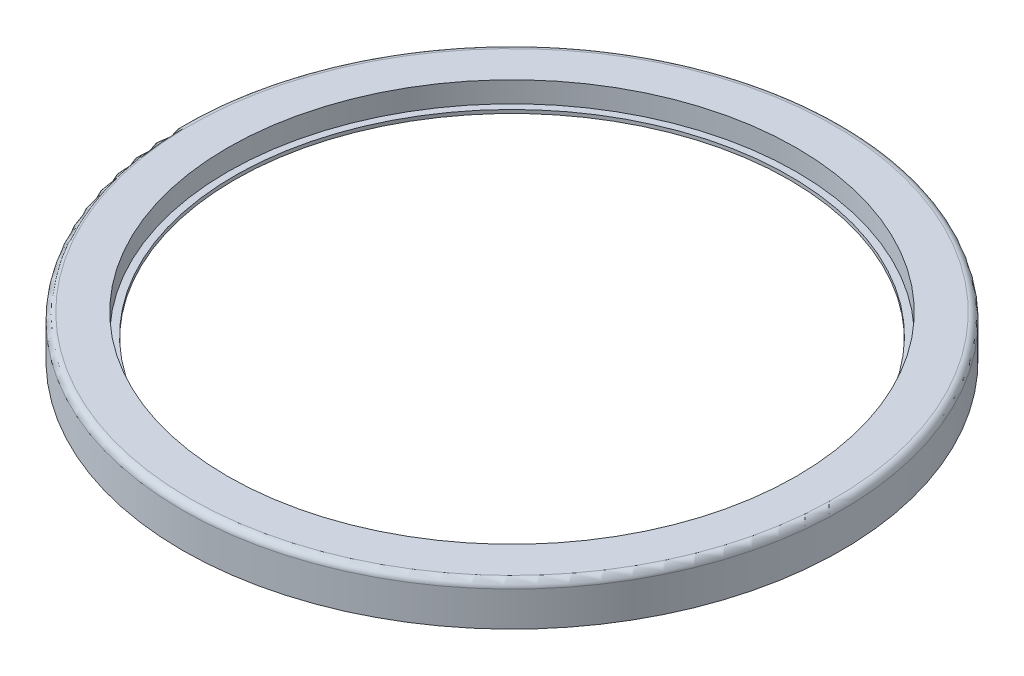
ISO-10303-21;
HEADER;
FILE_DESCRIPTION(('STEP AP214'),'2;1');
FILE_NAME('part.step','',(''),(''),'','','');
FILE_SCHEMA(('AUTOMOTIVE_DESIGN { 1 0 10303 214 1 1 1 1 }'));
ENDSEC;
DATA;
#1=APPLICATION_CONTEXT('core data for automotive mechanical design processes');
#2=APPLICATION_PROTOCOL_DEFINITION('international standard','automotive_design',2000,#1);
#3=PRODUCT_CONTEXT('',#1,'mechanical');
#4=PRODUCT('Part','Part','',(#3));
#5=PRODUCT_RELATED_PRODUCT_CATEGORY('part','',(#4));
#6=PRODUCT_DEFINITION_FORMATION('','',#4);
#7=PRODUCT_DEFINITION_CONTEXT('part definition',#1,'design');
#8=PRODUCT_DEFINITION('design','',#6,#7);
#9=PRODUCT_DEFINITION_SHAPE('','',#8);
#10=(LENGTH_UNIT() NAMED_UNIT(*) SI_UNIT(.MILLI.,.METRE.));
#11=(NAMED_UNIT(*) PLANE_ANGLE_UNIT() SI_UNIT($,.RADIAN.));
#12=(NAMED_UNIT(*) SI_UNIT($,.STERADIAN.) SOLID_ANGLE_UNIT());
#13=UNCERTAINTY_MEASURE_WITH_UNIT(LENGTH_MEASURE(1.E-05),#10,'distance_accuracy_value','');
#14=(GEOMETRIC_REPRESENTATION_CONTEXT(3) GLOBAL_UNCERTAINTY_ASSIGNED_CONTEXT((#13)) GLOBAL_UNIT_ASSIGNED_CONTEXT((#10,
#11,#12)) REPRESENTATION_CONTEXT('',''));
#15=CARTESIAN_POINT('',(0.,0.,0.));
#16=DIRECTION('',(0.,0.,1.));
#17=DIRECTION('',(1.,0.,0.));
#18=AXIS2_PLACEMENT_3D('',#15,#16,#17);
#19=CARTESIAN_POINT('',(0.,-4.,0.));
#20=DIRECTION('',(0.,1.,0.));
#21=DIRECTION('',(0.,0.,1.));
#22=AXIS2_PLACEMENT_3D('',#19,#20,#21);
#23=CYLINDRICAL_SURFACE('',#22,45.7);
#24=CARTESIAN_POINT('',(0.,0.,0.));
#25=DIRECTION('',(0.,-1.,0.));
#26=DIRECTION('',(0.,0.,-1.));
#27=AXIS2_PLACEMENT_3D('',#24,#25,#26);
#28=CIRCLE('',#27,45.7);
#29=CARTESIAN_POINT('',(0.,0.,-45.7));
#30=VERTEX_POINT('',#29);
#31=EDGE_CURVE('E67',#30,#30,#28,.T.);
#32=ORIENTED_EDGE('',*,*,#31,.F.);
#33=EDGE_LOOP('',(#32));
#34=FACE_BOUND('',#33,.T.);
#35=CARTESIAN_POINT('',(0.,-2.5,0.));
#36=DIRECTION('',(0.,-1.,0.));
#37=DIRECTION('',(0.,0.,-1.));
#38=AXIS2_PLACEMENT_3D('',#35,#36,#37);
#39=CIRCLE('',#38,45.7);
#40=CARTESIAN_POINT('',(0.,-2.5,-45.7));
#41=VERTEX_POINT('',#40);
#42=EDGE_CURVE('E87',#41,#41,#39,.T.);
#43=ORIENTED_EDGE('',*,*,#42,.T.);
#44=EDGE_LOOP('',(#43));
#45=FACE_BOUND('',#44,.T.);
#46=ADVANCED_FACE('F39',(#34,#45),#23,.F.);
#47=CARTESIAN_POINT('',(0.,0.,0.));
#48=DIRECTION('',(0.,1.,0.));
#49=DIRECTION('',(0.,0.,1.));
#50=AXIS2_PLACEMENT_3D('',#47,#48,#49);
#51=PLANE('',#50);
#52=CARTESIAN_POINT('',(0.,0.,0.));
#53=DIRECTION('',(0.,-1.,0.));
#54=DIRECTION('',(0.,0.,-1.));
#55=AXIS2_PLACEMENT_3D('',#52,#53,#54);
#56=CIRCLE('',#55,42.25);
#57=CARTESIAN_POINT('',(0.,0.,-42.25));
#58=VERTEX_POINT('',#57);
#59=EDGE_CURVE('E52',#58,#58,#56,.T.);
#60=ORIENTED_EDGE('',*,*,#59,.F.);
#61=EDGE_LOOP('',(#60));
#62=FACE_BOUND('',#61,.T.);
#63=ORIENTED_EDGE('',*,*,#31,.T.);
#64=EDGE_LOOP('',(#63));
#65=FACE_BOUND('',#64,.T.);
#66=ADVANCED_FACE('F125',(#62,#65),#51,.F.);
#67=CARTESIAN_POINT('',(0.,2.,0.));
#68=DIRECTION('',(0.,-1.,0.));
#69=DIRECTION('',(0.,0.,-1.));
#70=AXIS2_PLACEMENT_3D('',#67,#68,#69);
#71=CYLINDRICAL_SURFACE('',#70,47.5);
#72=CARTESIAN_POINT('',(0.,1.,0.));
#73=DIRECTION('',(0.,1.,0.));
#74=DIRECTION('',(0.,0.,1.));
#75=AXIS2_PLACEMENT_3D('',#72,#73,#74);
#76=CIRCLE('',#75,47.5);
#77=CARTESIAN_POINT('',(0.,1.,47.5));
#78=VERTEX_POINT('',#77);
#79=EDGE_CURVE('E10',#78,#78,#76,.F.);
#80=ORIENTED_EDGE('',*,*,#79,.T.);
#81=EDGE_LOOP('',(#80));
#82=FACE_BOUND('',#81,.T.);
#83=CARTESIAN_POINT('',(0.,-4.,0.));
#84=DIRECTION('',(0.,-1.,0.));
#85=DIRECTION('',(0.,0.,-1.));
#86=AXIS2_PLACEMENT_3D('',#83,#84,#85);
#87=CIRCLE('',#86,47.5);
#88=CARTESIAN_POINT('',(0.,-4.,-47.5));
#89=VERTEX_POINT('',#88);
#90=EDGE_CURVE('E62',#89,#89,#87,.T.);
#91=ORIENTED_EDGE('',*,*,#90,.F.);
#92=EDGE_LOOP('',(#91));
#93=FACE_BOUND('',#92,.T.);
#94=ADVANCED_FACE('F130',(#82,#93),#71,.T.);
#95=CARTESIAN_POINT('',(0.,2.,0.));
#96=DIRECTION('',(0.,1.,0.));
#97=DIRECTION('',(0.,0.,1.));
#98=AXIS2_PLACEMENT_3D('',#95,#96,#97);
#99=PLANE('',#98);
#100=CARTESIAN_POINT('',(0.,2.,0.));
#101=DIRECTION('',(0.,1.,0.));
#102=DIRECTION('',(0.,0.,1.));
#103=AXIS2_PLACEMENT_3D('',#100,#101,#102);
#104=CIRCLE('',#103,41.);
#105=CARTESIAN_POINT('',(0.,2.,41.));
#106=VERTEX_POINT('',#105);
#107=EDGE_CURVE('E72',#106,#106,#104,.T.);
#108=ORIENTED_EDGE('',*,*,#107,.F.);
#109=EDGE_LOOP('',(#108));
#110=FACE_BOUND('',#109,.T.);
#111=CARTESIAN_POINT('',(0.,2.,0.));
#112=DIRECTION('',(0.,1.,0.));
#113=DIRECTION('',(0.,0.,1.));
#114=AXIS2_PLACEMENT_3D('',#111,#112,#113);
#115=CIRCLE('',#114,46.5);
#116=CARTESIAN_POINT('',(0.,2.,46.5));
#117=VERTEX_POINT('',#116);
#118=EDGE_CURVE('E47',#117,#117,#115,.T.);
#119=ORIENTED_EDGE('',*,*,#118,.T.);
#120=EDGE_LOOP('',(#119));
#121=FACE_BOUND('',#120,.T.);
#122=ADVANCED_FACE('F200',(#110,#121),#99,.T.);
#123=CARTESIAN_POINT('',(0.,0.,0.));
#124=DIRECTION('',(0.,1.,0.));
#125=DIRECTION('',(0.,0.,-1.));
#126=AXIS2_PLACEMENT_3D('',#123,#124,#125);
#127=CONICAL_SURFACE('',#126,42.25,0.0349065850398867);
#128=CARTESIAN_POINT('',(0.,-1.5,0.));
#129=DIRECTION('',(0.,-1.,0.));
#130=DIRECTION('',(0.,0.,-1.));
#131=AXIS2_PLACEMENT_3D('',#128,#129,#130);
#132=CIRCLE('',#131,42.1976188457624);
#133=CARTESIAN_POINT('',(0.,-1.5,-42.1976188457624));
#134=VERTEX_POINT('',#133);
#135=EDGE_CURVE('E57',#134,#134,#132,.T.);
#136=ORIENTED_EDGE('',*,*,#135,.F.);
#137=EDGE_LOOP('',(#136));
#138=FACE_BOUND('',#137,.T.);
#139=ORIENTED_EDGE('',*,*,#59,.T.);
#140=EDGE_LOOP('',(#139));
#141=FACE_BOUND('',#140,.T.);
#142=ADVANCED_FACE('F120',(#138,#141),#127,.T.);
#143=CARTESIAN_POINT('',(0.,-1.5,0.));
#144=DIRECTION('',(0.,-1.,0.));
#145=DIRECTION('',(0.,0.,-1.));
#146=AXIS2_PLACEMENT_3D('',#143,#144,#145);
#147=PLANE('',#146);
#148=CARTESIAN_POINT('',(0.,-1.5,0.));
#149=DIRECTION('',(0.,-1.,0.));
#150=DIRECTION('',(0.,0.,-1.));
#151=AXIS2_PLACEMENT_3D('',#148,#149,#150);
#152=CIRCLE('',#151,40.);
#153=CARTESIAN_POINT('',(0.,-1.5,-40.));
#154=VERTEX_POINT('',#153);
#155=EDGE_CURVE('E76',#154,#154,#152,.T.);
#156=ORIENTED_EDGE('',*,*,#155,.F.);
#157=EDGE_LOOP('',(#156));
#158=FACE_BOUND('',#157,.T.);
#159=ORIENTED_EDGE('',*,*,#135,.T.);
#160=EDGE_LOOP('',(#159));
#161=FACE_BOUND('',#160,.T.);
#162=ADVANCED_FACE('F111',(#158,#161),#147,.T.);
#163=CARTESIAN_POINT('',(0.,-4.,0.));
#164=DIRECTION('',(0.,-1.,0.));
#165=DIRECTION('',(0.,0.,-1.));
#166=AXIS2_PLACEMENT_3D('',#163,#164,#165);
#167=PLANE('',#166);
#168=ORIENTED_EDGE('',*,*,#90,.T.);
#169=EDGE_LOOP('',(#168));
#170=FACE_BOUND('',#169,.T.);
#171=CARTESIAN_POINT('',(0.,-4.,0.));
#172=DIRECTION('',(0.,-1.,0.));
#173=DIRECTION('',(0.,0.,-1.));
#174=AXIS2_PLACEMENT_3D('',#171,#172,#173);
#175=CIRCLE('',#174,45.2);
#176=CARTESIAN_POINT('',(0.,-4.,-45.2));
#177=VERTEX_POINT('',#176);
#178=EDGE_CURVE('E92',#177,#177,#175,.T.);
#179=ORIENTED_EDGE('',*,*,#178,.F.);
#180=EDGE_LOOP('',(#179));
#181=FACE_BOUND('',#180,.T.);
#182=ADVANCED_FACE('F109',(#170,#181),#167,.T.);
#183=CARTESIAN_POINT('',(0.,1.,0.));
#184=DIRECTION('',(0.,1.,0.));
#185=DIRECTION('',(0.,0.,1.));
#186=AXIS2_PLACEMENT_3D('',#183,#184,#185);
#187=TOROIDAL_SURFACE('',#186,46.5,1.);
#188=ORIENTED_EDGE('',*,*,#79,.F.);
#189=EDGE_LOOP('',(#188));
#190=FACE_BOUND('',#189,.T.);
#191=ORIENTED_EDGE('',*,*,#118,.F.);
#192=EDGE_LOOP('',(#191));
#193=FACE_BOUND('',#192,.T.);
#194=ADVANCED_FACE('F41',(#190,#193),#187,.T.);
#195=CARTESIAN_POINT('',(0.,-1.,0.));
#196=DIRECTION('',(0.,1.,0.));
#197=DIRECTION('',(0.,0.,1.));
#198=AXIS2_PLACEMENT_3D('',#195,#196,#197);
#199=CYLINDRICAL_SURFACE('',#198,41.);
#200=CARTESIAN_POINT('',(0.,-1.,0.));
#201=DIRECTION('',(0.,1.,0.));
#202=DIRECTION('',(0.,0.,1.));
#203=AXIS2_PLACEMENT_3D('',#200,#201,#202);
#204=CIRCLE('',#203,41.);
#205=CARTESIAN_POINT('',(0.,-1.,41.));
#206=VERTEX_POINT('',#205);
#207=EDGE_CURVE('E71',#206,#206,#204,.T.);
#208=ORIENTED_EDGE('',*,*,#207,.F.);
#209=EDGE_LOOP('',(#208));
#210=FACE_BOUND('',#209,.T.);
#211=ORIENTED_EDGE('',*,*,#107,.T.);
#212=EDGE_LOOP('',(#211));
#213=FACE_BOUND('',#212,.T.);
#214=ADVANCED_FACE('F118',(#210,#213),#199,.F.);
#215=CARTESIAN_POINT('',(0.,-1.,0.));
#216=DIRECTION('',(0.,1.,0.));
#217=DIRECTION('',(0.,0.,1.));
#218=AXIS2_PLACEMENT_3D('',#215,#216,#217);
#219=PLANE('',#218);
#220=CARTESIAN_POINT('',(0.,-1.,0.));
#221=DIRECTION('',(0.,1.,0.));
#222=DIRECTION('',(0.,0.,1.));
#223=AXIS2_PLACEMENT_3D('',#220,#221,#222);
#224=CIRCLE('',#223,40.);
#225=CARTESIAN_POINT('',(0.,-1.,40.));
#226=VERTEX_POINT('',#225);
#227=EDGE_CURVE('E83',#226,#226,#224,.T.);
#228=ORIENTED_EDGE('',*,*,#227,.F.);
#229=EDGE_LOOP('',(#228));
#230=FACE_BOUND('',#229,.T.);
#231=ORIENTED_EDGE('',*,*,#207,.T.);
#232=EDGE_LOOP('',(#231));
#233=FACE_BOUND('',#232,.T.);
#234=ADVANCED_FACE('F138',(#230,#233),#219,.T.);
#235=CARTESIAN_POINT('',(0.,-6.,0.));
#236=DIRECTION('',(0.,1.,0.));
#237=DIRECTION('',(0.,0.,1.));
#238=AXIS2_PLACEMENT_3D('',#235,#236,#237);
#239=CYLINDRICAL_SURFACE('',#238,40.);
#240=ORIENTED_EDGE('',*,*,#155,.T.);
#241=EDGE_LOOP('',(#240));
#242=FACE_BOUND('',#241,.T.);
#243=ORIENTED_EDGE('',*,*,#227,.T.);
#244=EDGE_LOOP('',(#243));
#245=FACE_BOUND('',#244,.T.);
#246=ADVANCED_FACE('F142',(#242,#245),#239,.F.);
#247=CARTESIAN_POINT('',(0.,-2.5,0.));
#248=DIRECTION('',(0.,-1.,0.));
#249=DIRECTION('',(0.,0.,-1.));
#250=AXIS2_PLACEMENT_3D('',#247,#248,#249);
#251=PLANE('',#250);
#252=CARTESIAN_POINT('',(0.,-2.5,0.));
#253=DIRECTION('',(0.,-1.,0.));
#254=DIRECTION('',(0.,0.,-1.));
#255=AXIS2_PLACEMENT_3D('',#252,#253,#254);
#256=CIRCLE('',#255,45.2);
#257=CARTESIAN_POINT('',(0.,-2.5,-45.2));
#258=VERTEX_POINT('',#257);
#259=EDGE_CURVE('E91',#258,#258,#256,.T.);
#260=ORIENTED_EDGE('',*,*,#259,.T.);
#261=EDGE_LOOP('',(#260));
#262=FACE_BOUND('',#261,.T.);
#263=ORIENTED_EDGE('',*,*,#42,.F.);
#264=EDGE_LOOP('',(#263));
#265=FACE_BOUND('',#264,.T.);
#266=ADVANCED_FACE('F100',(#262,#265),#251,.F.);
#267=CARTESIAN_POINT('',(0.,-2.5,0.));
#268=DIRECTION('',(0.,-1.,0.));
#269=DIRECTION('',(0.,0.,-1.));
#270=AXIS2_PLACEMENT_3D('',#267,#268,#269);
#271=CYLINDRICAL_SURFACE('',#270,45.2);
#272=ORIENTED_EDGE('',*,*,#259,.F.);
#273=EDGE_LOOP('',(#272));
#274=FACE_BOUND('',#273,.T.);
#275=ORIENTED_EDGE('',*,*,#178,.T.);
#276=EDGE_LOOP('',(#275));
#277=FACE_BOUND('',#276,.T.);
#278=ADVANCED_FACE('F103',(#274,#277),#271,.F.);
#279=CLOSED_SHELL('',(#46,#66,#94,#122,#142,#162,#182,#194,#214,#234,#246,#266,#278));
#280=MANIFOLD_SOLID_BREP('B2',#279);
#281=ADVANCED_BREP_SHAPE_REPRESENTATION('',(#18,#280),#14);
#282=SHAPE_DEFINITION_REPRESENTATION(#9,#281);
ENDSEC;
END-ISO-10303-21;
